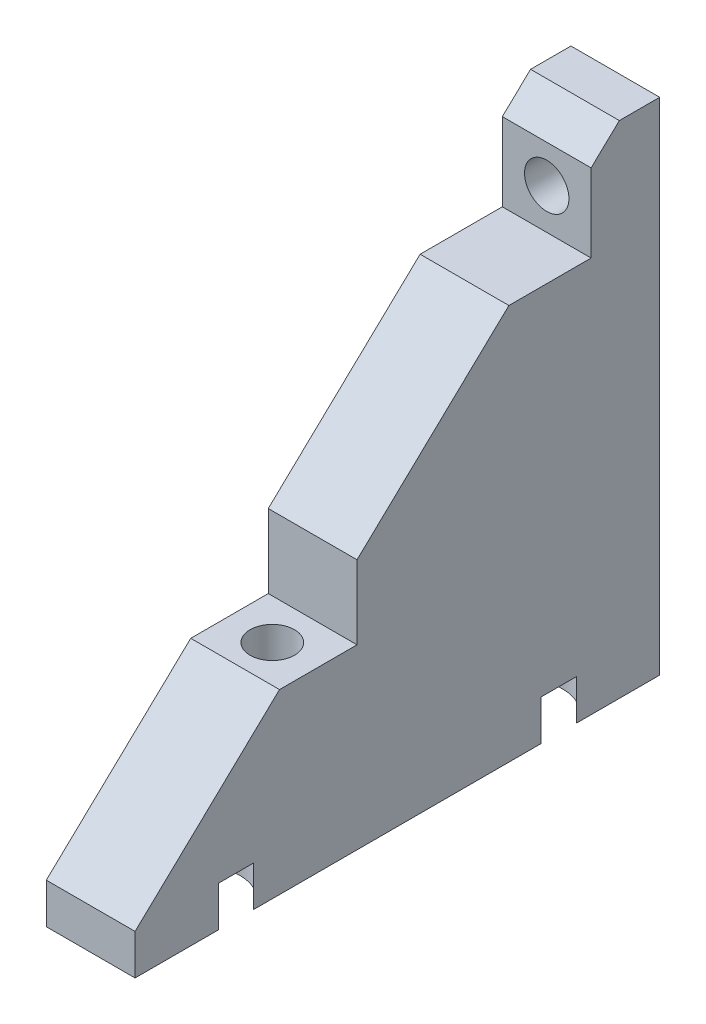
ISO-10303-21;
HEADER;
FILE_DESCRIPTION(('STEP AP214'),'2;1');
FILE_NAME('part.step','',(''),(''),'','','');
FILE_SCHEMA(('AUTOMOTIVE_DESIGN { 1 0 10303 214 1 1 1 1 }'));
ENDSEC;
DATA;
#1=APPLICATION_CONTEXT('core data for automotive mechanical design processes');
#2=APPLICATION_PROTOCOL_DEFINITION('international standard','automotive_design',2000,#1);
#3=PRODUCT_CONTEXT('',#1,'mechanical');
#4=PRODUCT('Part','Part','',(#3));
#5=PRODUCT_RELATED_PRODUCT_CATEGORY('part','',(#4));
#6=PRODUCT_DEFINITION_FORMATION('','',#4);
#7=PRODUCT_DEFINITION_CONTEXT('part definition',#1,'design');
#8=PRODUCT_DEFINITION('design','',#6,#7);
#9=PRODUCT_DEFINITION_SHAPE('','',#8);
#10=(LENGTH_UNIT() NAMED_UNIT(*) SI_UNIT(.MILLI.,.METRE.));
#11=(NAMED_UNIT(*) PLANE_ANGLE_UNIT() SI_UNIT($,.RADIAN.));
#12=(NAMED_UNIT(*) SI_UNIT($,.STERADIAN.) SOLID_ANGLE_UNIT());
#13=UNCERTAINTY_MEASURE_WITH_UNIT(LENGTH_MEASURE(1.E-05),#10,'distance_accuracy_value','');
#14=(GEOMETRIC_REPRESENTATION_CONTEXT(3) GLOBAL_UNCERTAINTY_ASSIGNED_CONTEXT((#13)) GLOBAL_UNIT_ASSIGNED_CONTEXT((#10,
#11,#12)) REPRESENTATION_CONTEXT('',''));
#15=CARTESIAN_POINT('',(0.,0.,0.));
#16=DIRECTION('',(0.,0.,1.));
#17=DIRECTION('',(1.,0.,0.));
#18=AXIS2_PLACEMENT_3D('',#15,#16,#17);
#19=CARTESIAN_POINT('',(0.,-120.,0.));
#20=DIRECTION('',(0.,-1.,0.));
#21=DIRECTION('',(0.,0.,-1.));
#22=AXIS2_PLACEMENT_3D('',#19,#20,#21);
#23=PLANE('',#22);
#24=CARTESIAN_POINT('',(20.,-120.,37.5));
#25=DIRECTION('',(0.,-1.,0.));
#26=DIRECTION('',(0.,0.,-1.));
#27=AXIS2_PLACEMENT_3D('',#24,#25,#26);
#28=CIRCLE('',#27,2.75);
#29=CARTESIAN_POINT('',(20.,-120.,34.75));
#30=VERTEX_POINT('',#29);
#31=EDGE_CURVE('E231',#30,#30,#28,.T.);
#32=ORIENTED_EDGE('',*,*,#31,.T.);
#33=EDGE_LOOP('',(#32));
#34=FACE_BOUND('',#33,.T.);
#35=DIRECTION('',(0.,0.,1.));
#36=VECTOR('',#35,1.);
#37=CARTESIAN_POINT('',(25.5,-120.,-5.));
#38=LINE('',#37,#36);
#39=CARTESIAN_POINT('',(25.5,-120.,32.5));
#40=VERTEX_POINT('',#39);
#41=CARTESIAN_POINT('',(25.5,-120.,42.1052631578947));
#42=VERTEX_POINT('',#41);
#43=EDGE_CURVE('E216',#40,#42,#38,.T.);
#44=ORIENTED_EDGE('',*,*,#43,.F.);
#45=DIRECTION('',(1.,0.,0.));
#46=VECTOR('',#45,1.);
#47=CARTESIAN_POINT('',(-32.5,-120.,32.5));
#48=LINE('',#47,#46);
#49=CARTESIAN_POINT('',(14.5,-120.,32.5));
#50=VERTEX_POINT('',#49);
#51=EDGE_CURVE('E199',#50,#40,#48,.T.);
#52=ORIENTED_EDGE('',*,*,#51,.F.);
#53=DIRECTION('',(0.,0.,-1.));
#54=VECTOR('',#53,1.);
#55=CARTESIAN_POINT('',(14.5,-120.,-5.));
#56=LINE('',#55,#54);
#57=CARTESIAN_POINT('',(14.5,-120.,42.1052631578947));
#58=VERTEX_POINT('',#57);
#59=EDGE_CURVE('E220',#58,#50,#56,.T.);
#60=ORIENTED_EDGE('',*,*,#59,.F.);
#61=DIRECTION('',(-1.,0.,0.));
#62=VECTOR('',#61,1.);
#63=CARTESIAN_POINT('',(-32.5,-120.,42.1052631578947));
#64=LINE('',#63,#62);
#65=EDGE_CURVE('E185',#42,#58,#64,.T.);
#66=ORIENTED_EDGE('',*,*,#65,.F.);
#67=EDGE_LOOP('',(#44,#52,#60,#66));
#68=FACE_BOUND('',#67,.T.);
#69=ADVANCED_FACE('F39',(#34,#68),#23,.F.);
#70=CARTESIAN_POINT('',(-32.5,-120.,32.5));
#71=DIRECTION('',(0.,0.,1.));
#72=DIRECTION('',(1.,0.,0.));
#73=AXIS2_PLACEMENT_3D('',#70,#71,#72);
#74=PLANE('',#73);
#75=DIRECTION('',(-1.,0.,0.));
#76=VECTOR('',#75,1.);
#77=CARTESIAN_POINT('',(-32.5,-110.875,32.5));
#78=LINE('',#77,#76);
#79=CARTESIAN_POINT('',(25.5,-110.875,32.5));
#80=VERTEX_POINT('',#79);
#81=CARTESIAN_POINT('',(14.5,-110.875,32.5));
#82=VERTEX_POINT('',#81);
#83=EDGE_CURVE('E48',#80,#82,#78,.T.);
#84=ORIENTED_EDGE('',*,*,#83,.T.);
#85=DIRECTION('',(0.,1.,0.));
#86=VECTOR('',#85,1.);
#87=CARTESIAN_POINT('',(14.5,-120.,32.5));
#88=LINE('',#87,#86);
#89=EDGE_CURVE('E224',#50,#82,#88,.T.);
#90=ORIENTED_EDGE('',*,*,#89,.F.);
#91=ORIENTED_EDGE('',*,*,#51,.T.);
#92=DIRECTION('',(0.,1.,0.));
#93=VECTOR('',#92,1.);
#94=CARTESIAN_POINT('',(25.5,-120.,32.5));
#95=LINE('',#94,#93);
#96=EDGE_CURVE('E228',#40,#80,#95,.T.);
#97=ORIENTED_EDGE('',*,*,#96,.T.);
#98=EDGE_LOOP('',(#84,#90,#91,#97));
#99=FACE_BOUND('',#98,.T.);
#100=ADVANCED_FACE('F293',(#99),#74,.T.);
#101=CARTESIAN_POINT('',(-32.5,-137.,60.));
#102=DIRECTION('',(0.,-0.724999433594413,-0.688749461914693));
#103=DIRECTION('',(0.,0.688749461914694,-0.724999433594413));
#104=AXIS2_PLACEMENT_3D('',#101,#102,#103);
#105=PLANE('',#104);
#106=DIRECTION('',(0.,0.688749461914693,-0.724999433594413));
#107=VECTOR('',#106,1.);
#108=CARTESIAN_POINT('',(25.5,-137.,60.));
#109=LINE('',#108,#107);
#110=CARTESIAN_POINT('',(25.5,-93.,13.6842105263158));
#111=VERTEX_POINT('',#110);
#112=EDGE_CURVE('E245',#80,#111,#109,.T.);
#113=ORIENTED_EDGE('',*,*,#112,.T.);
#114=DIRECTION('',(-1.,0.,0.));
#115=VECTOR('',#114,1.);
#116=CARTESIAN_POINT('',(-32.5,-93.,13.6842105263158));
#117=LINE('',#116,#115);
#118=CARTESIAN_POINT('',(14.5,-93.,13.6842105263157));
#119=VERTEX_POINT('',#118);
#120=EDGE_CURVE('E11',#111,#119,#117,.T.);
#121=ORIENTED_EDGE('',*,*,#120,.T.);
#122=DIRECTION('',(0.,0.688749461914694,-0.724999433594413));
#123=VECTOR('',#122,1.);
#124=CARTESIAN_POINT('',(14.5,-51.0630749014454,-30.4599211563732));
#125=LINE('',#124,#123);
#126=EDGE_CURVE('E259',#82,#119,#125,.T.);
#127=ORIENTED_EDGE('',*,*,#126,.F.);
#128=ORIENTED_EDGE('',*,*,#83,.F.);
#129=EDGE_LOOP('',(#113,#121,#127,#128));
#130=FACE_BOUND('',#129,.T.);
#131=ADVANCED_FACE('F300',(#130),#105,.F.);
#132=CARTESIAN_POINT('',(-32.5,-93.,3.5));
#133=DIRECTION('',(0.,-1.,0.));
#134=DIRECTION('',(0.,0.,-1.));
#135=AXIS2_PLACEMENT_3D('',#132,#133,#134);
#136=PLANE('',#135);
#137=DIRECTION('',(0.,0.,1.));
#138=VECTOR('',#137,1.);
#139=CARTESIAN_POINT('',(25.5,-93.,3.5));
#140=LINE('',#139,#138);
#141=CARTESIAN_POINT('',(25.5,-93.,3.5));
#142=VERTEX_POINT('',#141);
#143=EDGE_CURVE('E201',#142,#111,#140,.T.);
#144=ORIENTED_EDGE('',*,*,#143,.F.);
#145=DIRECTION('',(1.,0.,0.));
#146=VECTOR('',#145,1.);
#147=CARTESIAN_POINT('',(-32.5,-93.,3.5));
#148=LINE('',#147,#146);
#149=CARTESIAN_POINT('',(14.5,-93.,3.5));
#150=VERTEX_POINT('',#149);
#151=EDGE_CURVE('E345',#150,#142,#148,.T.);
#152=ORIENTED_EDGE('',*,*,#151,.F.);
#153=DIRECTION('',(0.,0.,1.));
#154=VECTOR('',#153,1.);
#155=CARTESIAN_POINT('',(14.5,-93.,3.5));
#156=LINE('',#155,#154);
#157=EDGE_CURVE('E194',#150,#119,#156,.T.);
#158=ORIENTED_EDGE('',*,*,#157,.T.);
#159=ORIENTED_EDGE('',*,*,#120,.F.);
#160=EDGE_LOOP('',(#144,#152,#158,#159));
#161=FACE_BOUND('',#160,.T.);
#162=ADVANCED_FACE('F305',(#161),#136,.F.);
#163=CARTESIAN_POINT('',(0.,0.,3.5));
#164=DIRECTION('',(0.,0.,1.));
#165=DIRECTION('',(1.,0.,0.));
#166=AXIS2_PLACEMENT_3D('',#163,#164,#165);
#167=PLANE('',#166);
#168=CARTESIAN_POINT('',(20.,-88.,3.5));
#169=DIRECTION('',(0.,0.,1.));
#170=DIRECTION('',(1.,0.,0.));
#171=AXIS2_PLACEMENT_3D('',#168,#169,#170);
#172=CIRCLE('',#171,2.75);
#173=CARTESIAN_POINT('',(22.75,-88.,3.5));
#174=VERTEX_POINT('',#173);
#175=EDGE_CURVE('E190',#174,#174,#172,.F.);
#176=ORIENTED_EDGE('',*,*,#175,.T.);
#177=EDGE_LOOP('',(#176));
#178=FACE_BOUND('',#177,.T.);
#179=DIRECTION('',(-1.,0.,0.));
#180=VECTOR('',#179,1.);
#181=CARTESIAN_POINT('',(-32.5,-83.325,3.5));
#182=LINE('',#181,#180);
#183=CARTESIAN_POINT('',(25.5,-83.325,3.5));
#184=VERTEX_POINT('',#183);
#185=CARTESIAN_POINT('',(14.5,-83.325,3.5));
#186=VERTEX_POINT('',#185);
#187=EDGE_CURVE('E193',#184,#186,#182,.T.);
#188=ORIENTED_EDGE('',*,*,#187,.T.);
#189=DIRECTION('',(0.,-1.,0.));
#190=VECTOR('',#189,1.);
#191=CARTESIAN_POINT('',(14.5000000000002,-142.,3.5));
#192=LINE('',#191,#190);
#193=EDGE_CURVE('E208',#186,#150,#192,.T.);
#194=ORIENTED_EDGE('',*,*,#193,.T.);
#195=ORIENTED_EDGE('',*,*,#151,.T.);
#196=DIRECTION('',(0.,1.,0.));
#197=VECTOR('',#196,1.);
#198=CARTESIAN_POINT('',(25.5,-142.,3.5));
#199=LINE('',#198,#197);
#200=EDGE_CURVE('E374',#142,#184,#199,.T.);
#201=ORIENTED_EDGE('',*,*,#200,.T.);
#202=EDGE_LOOP('',(#188,#194,#195,#201));
#203=FACE_BOUND('',#202,.T.);
#204=ADVANCED_FACE('F381',(#178,#203),#167,.T.);
#205=ORIENTED_EDGE('',*,*,#187,.F.);
#206=CARTESIAN_POINT('',(25.5,-80.,0.));
#207=VERTEX_POINT('',#206);
#208=EDGE_CURVE('E239',#184,#207,#109,.T.);
#209=ORIENTED_EDGE('',*,*,#208,.T.);
#210=DIRECTION('',(1.,0.,0.));
#211=VECTOR('',#210,1.);
#212=CARTESIAN_POINT('',(-32.5,-80.,0.));
#213=LINE('',#212,#211);
#214=CARTESIAN_POINT('',(14.5,-80.,0.));
#215=VERTEX_POINT('',#214);
#216=EDGE_CURVE('E246',#215,#207,#213,.T.);
#217=ORIENTED_EDGE('',*,*,#216,.F.);
#218=EDGE_CURVE('E250',#186,#215,#125,.T.);
#219=ORIENTED_EDGE('',*,*,#218,.F.);
#220=EDGE_LOOP('',(#205,#209,#217,#219));
#221=FACE_BOUND('',#220,.T.);
#222=ADVANCED_FACE('F311',(#221),#105,.F.);
#223=CARTESIAN_POINT('',(20.,-88.,-5.));
#224=DIRECTION('',(0.,0.,1.));
#225=DIRECTION('',(1.,0.,0.));
#226=AXIS2_PLACEMENT_3D('',#223,#224,#225);
#227=CYLINDRICAL_SURFACE('',#226,2.75);
#228=CARTESIAN_POINT('',(20.,-88.,-5.));
#229=DIRECTION('',(0.,0.,1.));
#230=DIRECTION('',(-1.,0.,0.));
#231=AXIS2_PLACEMENT_3D('',#228,#229,#230);
#232=CIRCLE('',#231,2.75);
#233=CARTESIAN_POINT('',(17.25,-88.,-5.));
#234=VERTEX_POINT('',#233);
#235=EDGE_CURVE('E235',#234,#234,#232,.T.);
#236=ORIENTED_EDGE('',*,*,#235,.F.);
#237=EDGE_LOOP('',(#236));
#238=FACE_BOUND('',#237,.T.);
#239=ORIENTED_EDGE('',*,*,#175,.F.);
#240=EDGE_LOOP('',(#239));
#241=FACE_BOUND('',#240,.T.);
#242=ADVANCED_FACE('F308',(#238,#241),#227,.F.);
#243=CARTESIAN_POINT('',(20.,-142.,37.5));
#244=DIRECTION('',(0.,1.,0.));
#245=DIRECTION('',(0.,0.,1.));
#246=AXIS2_PLACEMENT_3D('',#243,#244,#245);
#247=CYLINDRICAL_SURFACE('',#246,2.75);
#248=ORIENTED_EDGE('',*,*,#31,.F.);
#249=EDGE_LOOP('',(#248));
#250=FACE_BOUND('',#249,.T.);
#251=CARTESIAN_POINT('',(20.,-142.,37.5));
#252=DIRECTION('',(0.,-1.,0.));
#253=DIRECTION('',(0.,0.,-1.));
#254=AXIS2_PLACEMENT_3D('',#251,#252,#253);
#255=CIRCLE('',#254,2.75);
#256=CARTESIAN_POINT('',(20.,-142.,34.75));
#257=VERTEX_POINT('',#256);
#258=EDGE_CURVE('E179',#257,#257,#255,.T.);
#259=ORIENTED_EDGE('',*,*,#258,.T.);
#260=EDGE_LOOP('',(#259));
#261=FACE_BOUND('',#260,.T.);
#262=ADVANCED_FACE('F279',(#250,#261),#247,.F.);
#263=CARTESIAN_POINT('',(14.5,-19.,0.));
#264=DIRECTION('',(1.,0.,0.));
#265=DIRECTION('',(0.,0.,-1.));
#266=AXIS2_PLACEMENT_3D('',#263,#264,#265);
#267=PLANE('',#266);
#268=ORIENTED_EDGE('',*,*,#126,.T.);
#269=ORIENTED_EDGE('',*,*,#157,.F.);
#270=ORIENTED_EDGE('',*,*,#193,.F.);
#271=ORIENTED_EDGE('',*,*,#218,.T.);
#272=DIRECTION('',(0.,0.,1.));
#273=VECTOR('',#272,1.);
#274=CARTESIAN_POINT('',(14.5,-80.,-5.));
#275=LINE('',#274,#273);
#276=CARTESIAN_POINT('',(14.5,-80.,-5.));
#277=VERTEX_POINT('',#276);
#278=EDGE_CURVE('E149',#277,#215,#275,.T.);
#279=ORIENTED_EDGE('',*,*,#278,.F.);
#280=DIRECTION('',(0.,1.,0.));
#281=VECTOR('',#280,1.);
#282=CARTESIAN_POINT('',(14.5,-80.,-5.));
#283=LINE('',#282,#281);
#284=CARTESIAN_POINT('',(14.5,-142.,-5.));
#285=VERTEX_POINT('',#284);
#286=EDGE_CURVE('E145',#285,#277,#283,.T.);
#287=ORIENTED_EDGE('',*,*,#286,.F.);
#288=DIRECTION('',(0.,0.,1.));
#289=VECTOR('',#288,1.);
#290=CARTESIAN_POINT('',(14.5,-142.,-5.));
#291=LINE('',#290,#289);
#292=CARTESIAN_POINT('',(14.5,-142.,60.));
#293=VERTEX_POINT('',#292);
#294=EDGE_CURVE('E55',#285,#293,#291,.T.);
#295=ORIENTED_EDGE('',*,*,#294,.T.);
#296=DIRECTION('',(0.,1.,0.));
#297=VECTOR('',#296,1.);
#298=CARTESIAN_POINT('',(14.5,-80.,60.));
#299=LINE('',#298,#297);
#300=CARTESIAN_POINT('',(14.5,-137.,60.));
#301=VERTEX_POINT('',#300);
#302=EDGE_CURVE('E155',#293,#301,#299,.T.);
#303=ORIENTED_EDGE('',*,*,#302,.T.);
#304=EDGE_CURVE('E254',#301,#58,#125,.T.);
#305=ORIENTED_EDGE('',*,*,#304,.T.);
#306=ORIENTED_EDGE('',*,*,#59,.T.);
#307=ORIENTED_EDGE('',*,*,#89,.T.);
#308=EDGE_LOOP('',(#268,#269,#270,#271,#279,#287,#295,#303,#305,#306,#307));
#309=FACE_BOUND('',#308,.T.);
#310=ADVANCED_FACE('F147',(#309),#267,.F.);
#311=CARTESIAN_POINT('',(25.5,-137.,60.));
#312=VERTEX_POINT('',#311);
#313=EDGE_CURVE('E240',#312,#42,#109,.T.);
#314=ORIENTED_EDGE('',*,*,#313,.T.);
#315=ORIENTED_EDGE('',*,*,#65,.T.);
#316=ORIENTED_EDGE('',*,*,#304,.F.);
#317=DIRECTION('',(1.,0.,0.));
#318=VECTOR('',#317,1.);
#319=CARTESIAN_POINT('',(-32.5,-137.,60.));
#320=LINE('',#319,#318);
#321=EDGE_CURVE('E244',#301,#312,#320,.T.);
#322=ORIENTED_EDGE('',*,*,#321,.T.);
#323=EDGE_LOOP('',(#314,#315,#316,#322));
#324=FACE_BOUND('',#323,.T.);
#325=ADVANCED_FACE('F313',(#324),#105,.F.);
#326=CARTESIAN_POINT('',(0.,-137.,0.));
#327=DIRECTION('',(0.,-1.,0.));
#328=DIRECTION('',(0.,0.,-1.));
#329=AXIS2_PLACEMENT_3D('',#326,#327,#328);
#330=PLANE('',#329);
#331=DIRECTION('',(0.,0.,-1.));
#332=VECTOR('',#331,1.);
#333=CARTESIAN_POINT('',(25.5,-137.,0.));
#334=LINE('',#333,#332);
#335=CARTESIAN_POINT('',(25.5,-137.,49.6794494717703));
#336=VERTEX_POINT('',#335);
#337=CARTESIAN_POINT('',(25.5,-137.,45.3205505282297));
#338=VERTEX_POINT('',#337);
#339=EDGE_CURVE('E263',#336,#338,#334,.T.);
#340=ORIENTED_EDGE('',*,*,#339,.F.);
#341=CARTESIAN_POINT('',(21.,-137.,47.5));
#342=DIRECTION('',(0.,-1.,0.));
#343=DIRECTION('',(0.,0.,-1.));
#344=AXIS2_PLACEMENT_3D('',#341,#342,#343);
#345=CIRCLE('',#344,5.);
#346=EDGE_CURVE('E264',#336,#338,#345,.T.);
#347=ORIENTED_EDGE('',*,*,#346,.T.);
#348=EDGE_LOOP('',(#340,#347));
#349=FACE_BOUND('',#348,.T.);
#350=ADVANCED_FACE('F316',(#349),#330,.T.);
#351=CARTESIAN_POINT('',(25.5,-19.,0.));
#352=DIRECTION('',(-1.,0.,0.));
#353=DIRECTION('',(0.,0.,1.));
#354=AXIS2_PLACEMENT_3D('',#351,#352,#353);
#355=PLANE('',#354);
#356=ORIENTED_EDGE('',*,*,#200,.F.);
#357=ORIENTED_EDGE('',*,*,#143,.T.);
#358=ORIENTED_EDGE('',*,*,#112,.F.);
#359=ORIENTED_EDGE('',*,*,#96,.F.);
#360=ORIENTED_EDGE('',*,*,#43,.T.);
#361=ORIENTED_EDGE('',*,*,#313,.F.);
#362=DIRECTION('',(0.,-1.,0.));
#363=VECTOR('',#362,1.);
#364=CARTESIAN_POINT('',(25.5,-80.,60.));
#365=LINE('',#364,#363);
#366=CARTESIAN_POINT('',(25.5,-142.,60.));
#367=VERTEX_POINT('',#366);
#368=EDGE_CURVE('E360',#312,#367,#365,.T.);
#369=ORIENTED_EDGE('',*,*,#368,.T.);
#370=DIRECTION('',(0.,0.,1.));
#371=VECTOR('',#370,1.);
#372=CARTESIAN_POINT('',(25.5,-142.,-5.));
#373=LINE('',#372,#371);
#374=CARTESIAN_POINT('',(25.5,-142.,49.6794494717703));
#375=VERTEX_POINT('',#374);
#376=EDGE_CURVE('E63',#375,#367,#373,.T.);
#377=ORIENTED_EDGE('',*,*,#376,.F.);
#378=DIRECTION('',(0.,1.,0.));
#379=VECTOR('',#378,1.);
#380=CARTESIAN_POINT('',(25.5,-142.,49.6794494717703));
#381=LINE('',#380,#379);
#382=EDGE_CURVE('E340',#375,#336,#381,.T.);
#383=ORIENTED_EDGE('',*,*,#382,.T.);
#384=ORIENTED_EDGE('',*,*,#339,.T.);
#385=DIRECTION('',(0.,1.,0.));
#386=VECTOR('',#385,1.);
#387=CARTESIAN_POINT('',(25.5,-142.,45.3205505282297));
#388=LINE('',#387,#386);
#389=CARTESIAN_POINT('',(25.5,-142.,45.3205505282297));
#390=VERTEX_POINT('',#389);
#391=EDGE_CURVE('E367',#338,#390,#388,.F.);
#392=ORIENTED_EDGE('',*,*,#391,.T.);
#393=CARTESIAN_POINT('',(25.5,-142.,9.67944947177028));
#394=VERTEX_POINT('',#393);
#395=EDGE_CURVE('E350',#394,#390,#373,.T.);
#396=ORIENTED_EDGE('',*,*,#395,.F.);
#397=DIRECTION('',(0.,1.,0.));
#398=VECTOR('',#397,1.);
#399=CARTESIAN_POINT('',(25.5,-142.,9.67944947177028));
#400=LINE('',#399,#398);
#401=CARTESIAN_POINT('',(25.5,-137.,9.67944947177031));
#402=VERTEX_POINT('',#401);
#403=EDGE_CURVE('E364',#394,#402,#400,.T.);
#404=ORIENTED_EDGE('',*,*,#403,.T.);
#405=CARTESIAN_POINT('',(25.5,-137.,5.32055052822968));
#406=VERTEX_POINT('',#405);
#407=EDGE_CURVE('E258',#402,#406,#334,.T.);
#408=ORIENTED_EDGE('',*,*,#407,.T.);
#409=DIRECTION('',(0.,1.,0.));
#410=VECTOR('',#409,1.);
#411=CARTESIAN_POINT('',(25.5,-142.,5.32055052822972));
#412=LINE('',#411,#410);
#413=CARTESIAN_POINT('',(25.5,-142.,5.32055052822972));
#414=VERTEX_POINT('',#413);
#415=EDGE_CURVE('E346',#406,#414,#412,.F.);
#416=ORIENTED_EDGE('',*,*,#415,.T.);
#417=CARTESIAN_POINT('',(25.5,-142.,-5.));
#418=VERTEX_POINT('',#417);
#419=EDGE_CURVE('E353',#418,#414,#373,.T.);
#420=ORIENTED_EDGE('',*,*,#419,.F.);
#421=DIRECTION('',(0.,-1.,0.));
#422=VECTOR('',#421,1.);
#423=CARTESIAN_POINT('',(25.5,-80.,-5.));
#424=LINE('',#423,#422);
#425=CARTESIAN_POINT('',(25.5,-80.,-5.));
#426=VERTEX_POINT('',#425);
#427=EDGE_CURVE('E170',#426,#418,#424,.T.);
#428=ORIENTED_EDGE('',*,*,#427,.F.);
#429=DIRECTION('',(0.,0.,1.));
#430=VECTOR('',#429,1.);
#431=CARTESIAN_POINT('',(25.5,-80.,-5.));
#432=LINE('',#431,#430);
#433=EDGE_CURVE('E357',#426,#207,#432,.T.);
#434=ORIENTED_EDGE('',*,*,#433,.T.);
#435=ORIENTED_EDGE('',*,*,#208,.F.);
#436=EDGE_LOOP('',(#356,#357,#358,#359,#360,#361,#369,#377,#383,#384,#392,#396,#404,#408,#416,
#420,#428,#434,#435));
#437=FACE_BOUND('',#436,.T.);
#438=ADVANCED_FACE('F320',(#437),#355,.F.);
#439=ORIENTED_EDGE('',*,*,#407,.F.);
#440=CARTESIAN_POINT('',(21.,-137.,7.5));
#441=DIRECTION('',(0.,-1.,0.));
#442=DIRECTION('',(0.,0.,1.));
#443=AXIS2_PLACEMENT_3D('',#440,#441,#442);
#444=CIRCLE('',#443,5.);
#445=EDGE_CURVE('E268',#402,#406,#444,.T.);
#446=ORIENTED_EDGE('',*,*,#445,.T.);
#447=EDGE_LOOP('',(#439,#446));
#448=FACE_BOUND('',#447,.T.);
#449=ADVANCED_FACE('F322',(#448),#330,.T.);
#450=CARTESIAN_POINT('',(21.,-142.,47.5));
#451=DIRECTION('',(0.,1.,0.));
#452=DIRECTION('',(0.,0.,1.));
#453=AXIS2_PLACEMENT_3D('',#450,#451,#452);
#454=CYLINDRICAL_SURFACE('',#453,5.);
#455=ORIENTED_EDGE('',*,*,#382,.F.);
#456=CARTESIAN_POINT('',(21.,-142.,47.5));
#457=DIRECTION('',(0.,-1.,0.));
#458=DIRECTION('',(0.,0.,-1.));
#459=AXIS2_PLACEMENT_3D('',#456,#457,#458);
#460=CIRCLE('',#459,5.);
#461=EDGE_CURVE('E172',#375,#390,#460,.T.);
#462=ORIENTED_EDGE('',*,*,#461,.T.);
#463=ORIENTED_EDGE('',*,*,#391,.F.);
#464=ORIENTED_EDGE('',*,*,#346,.F.);
#465=EDGE_LOOP('',(#455,#462,#463,#464));
#466=FACE_BOUND('',#465,.T.);
#467=ADVANCED_FACE('F329',(#466),#454,.F.);
#468=CARTESIAN_POINT('',(21.,-142.,7.5));
#469=DIRECTION('',(0.,1.,0.));
#470=DIRECTION('',(0.,0.,1.));
#471=AXIS2_PLACEMENT_3D('',#468,#469,#470);
#472=CYLINDRICAL_SURFACE('',#471,5.);
#473=ORIENTED_EDGE('',*,*,#403,.F.);
#474=CARTESIAN_POINT('',(21.,-142.,7.5));
#475=DIRECTION('',(0.,-1.,0.));
#476=DIRECTION('',(0.,0.,1.));
#477=AXIS2_PLACEMENT_3D('',#474,#475,#476);
#478=CIRCLE('',#477,5.);
#479=EDGE_CURVE('E269',#394,#414,#478,.T.);
#480=ORIENTED_EDGE('',*,*,#479,.T.);
#481=ORIENTED_EDGE('',*,*,#415,.F.);
#482=ORIENTED_EDGE('',*,*,#445,.F.);
#483=EDGE_LOOP('',(#473,#480,#481,#482));
#484=FACE_BOUND('',#483,.T.);
#485=ADVANCED_FACE('F288',(#484),#472,.F.);
#486=CARTESIAN_POINT('',(-32.5,-142.,60.));
#487=DIRECTION('',(0.,0.,-1.));
#488=DIRECTION('',(-1.,0.,0.));
#489=AXIS2_PLACEMENT_3D('',#486,#487,#488);
#490=PLANE('',#489);
#491=ORIENTED_EDGE('',*,*,#321,.F.);
#492=ORIENTED_EDGE('',*,*,#302,.F.);
#493=DIRECTION('',(-1.,0.,0.));
#494=VECTOR('',#493,1.);
#495=CARTESIAN_POINT('',(-32.5,-142.,60.));
#496=LINE('',#495,#494);
#497=EDGE_CURVE('E164',#367,#293,#496,.T.);
#498=ORIENTED_EDGE('',*,*,#497,.F.);
#499=ORIENTED_EDGE('',*,*,#368,.F.);
#500=EDGE_LOOP('',(#491,#492,#498,#499));
#501=FACE_BOUND('',#500,.T.);
#502=ADVANCED_FACE('F282',(#501),#490,.F.);
#503=CARTESIAN_POINT('',(0.,-142.,0.));
#504=DIRECTION('',(0.,1.,0.));
#505=DIRECTION('',(0.,0.,1.));
#506=AXIS2_PLACEMENT_3D('',#503,#504,#505);
#507=PLANE('',#506);
#508=ORIENTED_EDGE('',*,*,#258,.F.);
#509=EDGE_LOOP('',(#508));
#510=FACE_BOUND('',#509,.T.);
#511=ORIENTED_EDGE('',*,*,#497,.T.);
#512=ORIENTED_EDGE('',*,*,#294,.F.);
#513=DIRECTION('',(1.,0.,0.));
#514=VECTOR('',#513,1.);
#515=CARTESIAN_POINT('',(-32.5,-142.,-5.));
#516=LINE('',#515,#514);
#517=EDGE_CURVE('E162',#285,#418,#516,.T.);
#518=ORIENTED_EDGE('',*,*,#517,.T.);
#519=ORIENTED_EDGE('',*,*,#419,.T.);
#520=ORIENTED_EDGE('',*,*,#479,.F.);
#521=ORIENTED_EDGE('',*,*,#395,.T.);
#522=ORIENTED_EDGE('',*,*,#461,.F.);
#523=ORIENTED_EDGE('',*,*,#376,.T.);
#524=EDGE_LOOP('',(#511,#512,#518,#519,#520,#521,#522,#523));
#525=FACE_BOUND('',#524,.T.);
#526=ADVANCED_FACE('F160',(#510,#525),#507,.F.);
#527=CARTESIAN_POINT('',(0.,0.,-5.));
#528=DIRECTION('',(0.,0.,-1.));
#529=DIRECTION('',(-1.,0.,0.));
#530=AXIS2_PLACEMENT_3D('',#527,#528,#529);
#531=PLANE('',#530);
#532=ORIENTED_EDGE('',*,*,#286,.T.);
#533=DIRECTION('',(-1.,0.,0.));
#534=VECTOR('',#533,1.);
#535=CARTESIAN_POINT('',(-32.5,-80.,-5.));
#536=LINE('',#535,#534);
#537=EDGE_CURVE('E176',#426,#277,#536,.T.);
#538=ORIENTED_EDGE('',*,*,#537,.F.);
#539=ORIENTED_EDGE('',*,*,#427,.T.);
#540=ORIENTED_EDGE('',*,*,#517,.F.);
#541=EDGE_LOOP('',(#532,#538,#539,#540));
#542=FACE_BOUND('',#541,.T.);
#543=ORIENTED_EDGE('',*,*,#235,.T.);
#544=EDGE_LOOP('',(#543));
#545=FACE_BOUND('',#544,.T.);
#546=ADVANCED_FACE('F168',(#542,#545),#531,.T.);
#547=CARTESIAN_POINT('',(-32.5,-80.,-5.));
#548=DIRECTION('',(0.,1.,0.));
#549=DIRECTION('',(0.,0.,1.));
#550=AXIS2_PLACEMENT_3D('',#547,#548,#549);
#551=PLANE('',#550);
#552=ORIENTED_EDGE('',*,*,#278,.T.);
#553=ORIENTED_EDGE('',*,*,#216,.T.);
#554=ORIENTED_EDGE('',*,*,#433,.F.);
#555=ORIENTED_EDGE('',*,*,#537,.T.);
#556=EDGE_LOOP('',(#552,#553,#554,#555));
#557=FACE_BOUND('',#556,.T.);
#558=ADVANCED_FACE('F41',(#557),#551,.T.);
#559=CLOSED_SHELL('',(#69,#100,#131,#162,#204,#222,#242,#262,#310,#325,#350,#438,#449,#467,#485,
#502,#526,#546,#558));
#560=MANIFOLD_SOLID_BREP('B2',#559);
#561=ADVANCED_BREP_SHAPE_REPRESENTATION('',(#18,#560),#14);
#562=SHAPE_DEFINITION_REPRESENTATION(#9,#561);
ENDSEC;
END-ISO-10303-21;
